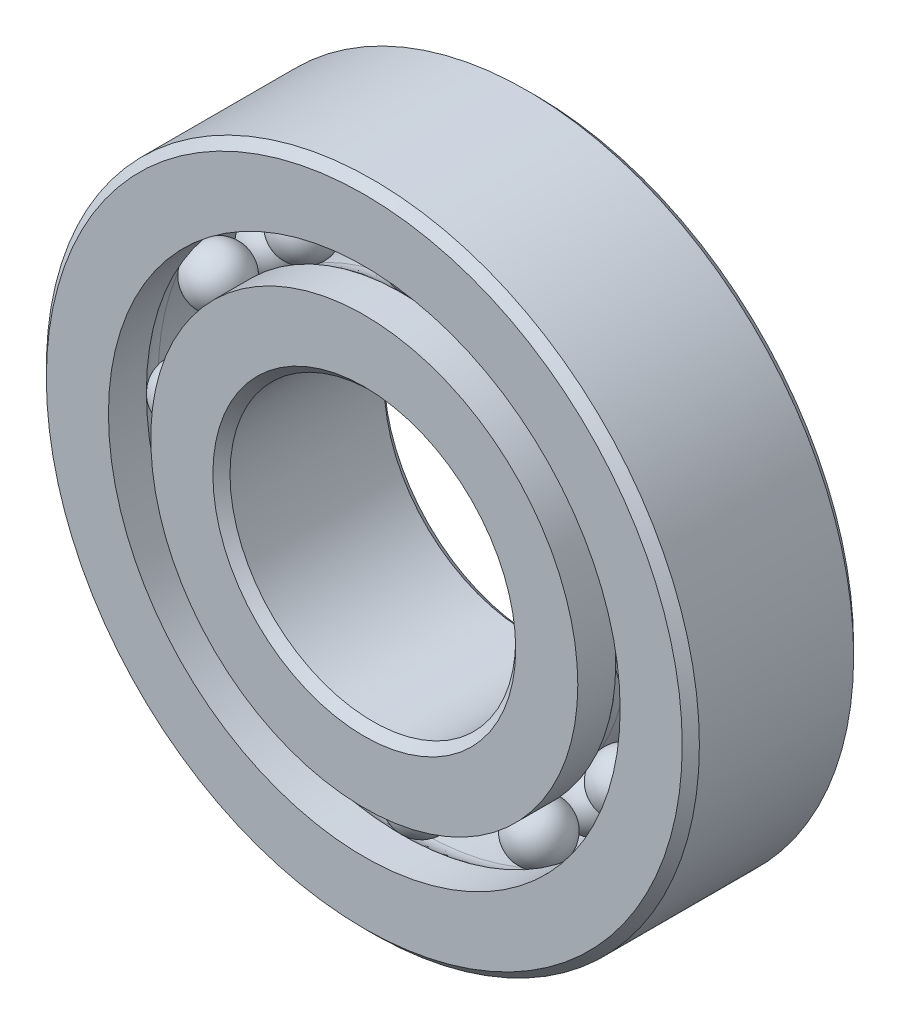
ISO-10303-21;
HEADER;
FILE_DESCRIPTION(('STEP AP214'),'2;1');
FILE_NAME('part.step','',(''),(''),'','','');
FILE_SCHEMA(('AUTOMOTIVE_DESIGN { 1 0 10303 214 1 1 1 1 }'));
ENDSEC;
DATA;
#1=APPLICATION_CONTEXT('core data for automotive mechanical design processes');
#2=APPLICATION_PROTOCOL_DEFINITION('international standard','automotive_design',2000,#1);
#3=PRODUCT_CONTEXT('',#1,'mechanical');
#4=PRODUCT('Part','Part','',(#3));
#5=PRODUCT_RELATED_PRODUCT_CATEGORY('part','',(#4));
#6=PRODUCT_DEFINITION_FORMATION('','',#4);
#7=PRODUCT_DEFINITION_CONTEXT('part definition',#1,'design');
#8=PRODUCT_DEFINITION('design','',#6,#7);
#9=PRODUCT_DEFINITION_SHAPE('','',#8);
#10=(LENGTH_UNIT() NAMED_UNIT(*) SI_UNIT(.MILLI.,.METRE.));
#11=(NAMED_UNIT(*) PLANE_ANGLE_UNIT() SI_UNIT($,.RADIAN.));
#12=(NAMED_UNIT(*) SI_UNIT($,.STERADIAN.) SOLID_ANGLE_UNIT());
#13=UNCERTAINTY_MEASURE_WITH_UNIT(LENGTH_MEASURE(1.E-05),#10,'distance_accuracy_value','');
#14=(GEOMETRIC_REPRESENTATION_CONTEXT(3) GLOBAL_UNCERTAINTY_ASSIGNED_CONTEXT((#13)) GLOBAL_UNIT_ASSIGNED_CONTEXT((#10,
#11,#12)) REPRESENTATION_CONTEXT('',''));
#15=CARTESIAN_POINT('',(0.,0.,0.));
#16=DIRECTION('',(0.,0.,1.));
#17=DIRECTION('',(1.,0.,0.));
#18=AXIS2_PLACEMENT_3D('',#15,#16,#17);
#19=CARTESIAN_POINT('',(-14.3749999999997,24.8982303588028,-3.5));
#20=DIRECTION('',(0.,0.,1.));
#21=DIRECTION('',(-0.499999999999989,0.866025403784445,0.));
#22=AXIS2_PLACEMENT_3D('',#19,#20,#21);
#23=SPHERICAL_SURFACE('',#22,3.5);
#24=CARTESIAN_POINT('',(-14.3749999999997,24.8982303588028,0.));
#25=VERTEX_POINT('',#24);
#26=VERTEX_LOOP('',#25);
#27=FACE_BOUND('',#26,.T.);
#28=ADVANCED_FACE('F41',(#27),#23,.T.);
#29=CLOSED_SHELL('',(#28));
#30=MANIFOLD_SOLID_BREP('B2',#29);
#31=CARTESIAN_POINT('',(-24.8982303588024,14.3750000000003,-3.5));
#32=DIRECTION('',(0.,0.,1.));
#33=DIRECTION('',(-0.866025403784433,0.50000000000001,0.));
#34=AXIS2_PLACEMENT_3D('',#31,#32,#33);
#35=SPHERICAL_SURFACE('',#34,3.5);
#36=CARTESIAN_POINT('',(-24.8982303588024,14.3750000000003,0.));
#37=VERTEX_POINT('',#36);
#38=VERTEX_LOOP('',#37);
#39=FACE_BOUND('',#38,.T.);
#40=ADVANCED_FACE('F61',(#39),#35,.T.);
#41=CLOSED_SHELL('',(#40));
#42=MANIFOLD_SOLID_BREP('B6',#41);
#43=CARTESIAN_POINT('',(-28.75,3.0114026547522E-13,-3.5));
#44=DIRECTION('',(0.,0.,1.));
#45=DIRECTION('',(-1.,0.,0.));
#46=AXIS2_PLACEMENT_3D('',#43,#44,#45);
#47=SPHERICAL_SURFACE('',#46,3.5);
#48=CARTESIAN_POINT('',(-28.75,3.0114026547522E-13,0.));
#49=VERTEX_POINT('',#48);
#50=VERTEX_LOOP('',#49);
#51=FACE_BOUND('',#50,.T.);
#52=ADVANCED_FACE('F81',(#51),#47,.T.);
#53=CLOSED_SHELL('',(#52));
#54=MANIFOLD_SOLID_BREP('B37',#53);
#55=CARTESIAN_POINT('',(-24.8982303588027,-14.3749999999998,-3.5));
#56=DIRECTION('',(0.,0.,1.));
#57=DIRECTION('',(-0.866025403784443,-0.499999999999992,0.));
#58=AXIS2_PLACEMENT_3D('',#55,#56,#57);
#59=SPHERICAL_SURFACE('',#58,3.5);
#60=CARTESIAN_POINT('',(-24.8982303588027,-14.3749999999998,0.));
#61=VERTEX_POINT('',#60);
#62=VERTEX_LOOP('',#61);
#63=FACE_BOUND('',#62,.T.);
#64=ADVANCED_FACE('F101',(#63),#59,.T.);
#65=CLOSED_SHELL('',(#64));
#66=MANIFOLD_SOLID_BREP('B57',#65);
#67=CARTESIAN_POINT('',(-14.3750000000002,-24.8982303588025,-3.5));
#68=DIRECTION('',(0.,0.,1.));
#69=DIRECTION('',(-0.500000000000007,-0.866025403784435,0.));
#70=AXIS2_PLACEMENT_3D('',#67,#68,#69);
#71=SPHERICAL_SURFACE('',#70,3.5);
#72=CARTESIAN_POINT('',(-14.3750000000002,-24.8982303588025,0.));
#73=VERTEX_POINT('',#72);
#74=VERTEX_LOOP('',#73);
#75=FACE_BOUND('',#74,.T.);
#76=ADVANCED_FACE('F121',(#75),#71,.T.);
#77=CLOSED_SHELL('',(#76));
#78=MANIFOLD_SOLID_BREP('B77',#77);
#79=CARTESIAN_POINT('',(-2.0076017698348E-13,-28.75,-3.5));
#80=DIRECTION('',(0.,0.,1.));
#81=DIRECTION('',(0.,-1.,0.));
#82=AXIS2_PLACEMENT_3D('',#79,#80,#81);
#83=SPHERICAL_SURFACE('',#82,3.5);
#84=CARTESIAN_POINT('',(-2.0076017698348E-13,-28.75,0.));
#85=VERTEX_POINT('',#84);
#86=VERTEX_LOOP('',#85);
#87=FACE_BOUND('',#86,.T.);
#88=ADVANCED_FACE('F141',(#87),#83,.T.);
#89=CLOSED_SHELL('',(#88));
#90=MANIFOLD_SOLID_BREP('B97',#89);
#91=CARTESIAN_POINT('',(14.3749999999999,-24.8982303588027,-3.5));
#92=DIRECTION('',(0.,0.,1.));
#93=DIRECTION('',(0.499999999999995,-0.866025403784442,0.));
#94=AXIS2_PLACEMENT_3D('',#91,#92,#93);
#95=SPHERICAL_SURFACE('',#94,3.5);
#96=CARTESIAN_POINT('',(14.3749999999999,-24.8982303588027,0.));
#97=VERTEX_POINT('',#96);
#98=VERTEX_LOOP('',#97);
#99=FACE_BOUND('',#98,.T.);
#100=ADVANCED_FACE('F161',(#99),#95,.T.);
#101=CLOSED_SHELL('',(#100));
#102=MANIFOLD_SOLID_BREP('B117',#101);
#103=CARTESIAN_POINT('',(24.8982303588026,-14.3750000000001,-3.5));
#104=DIRECTION('',(0.,0.,1.));
#105=DIRECTION('',(0.866025403784436,-0.500000000000004,0.));
#106=AXIS2_PLACEMENT_3D('',#103,#104,#105);
#107=SPHERICAL_SURFACE('',#106,3.5);
#108=CARTESIAN_POINT('',(24.8982303588026,-14.3750000000001,0.));
#109=VERTEX_POINT('',#108);
#110=VERTEX_LOOP('',#109);
#111=FACE_BOUND('',#110,.T.);
#112=ADVANCED_FACE('F181',(#111),#107,.T.);
#113=CLOSED_SHELL('',(#112));
#114=MANIFOLD_SOLID_BREP('B137',#113);
#115=CARTESIAN_POINT('',(28.75,-1.0038008849174E-13,-3.5));
#116=DIRECTION('',(0.,0.,1.));
#117=DIRECTION('',(1.,0.,0.));
#118=AXIS2_PLACEMENT_3D('',#115,#116,#117);
#119=SPHERICAL_SURFACE('',#118,3.5);
#120=CARTESIAN_POINT('',(28.75,-1.0038008849174E-13,0.));
#121=VERTEX_POINT('',#120);
#122=VERTEX_LOOP('',#121);
#123=FACE_BOUND('',#122,.T.);
#124=ADVANCED_FACE('F201',(#123),#119,.T.);
#125=CLOSED_SHELL('',(#124));
#126=MANIFOLD_SOLID_BREP('B157',#125);
#127=CARTESIAN_POINT('',(24.8982303588026,14.3749999999999,-3.5));
#128=DIRECTION('',(0.,0.,1.));
#129=DIRECTION('',(0.86602540378444,0.499999999999998,0.));
#130=AXIS2_PLACEMENT_3D('',#127,#128,#129);
#131=SPHERICAL_SURFACE('',#130,3.5);
#132=CARTESIAN_POINT('',(24.8982303588026,14.3749999999999,0.));
#133=VERTEX_POINT('',#132);
#134=VERTEX_LOOP('',#133);
#135=FACE_BOUND('',#134,.T.);
#136=ADVANCED_FACE('F221',(#135),#131,.T.);
#137=CLOSED_SHELL('',(#136));
#138=MANIFOLD_SOLID_BREP('B177',#137);
#139=CARTESIAN_POINT('',(14.375,24.8982303588026,-3.5));
#140=DIRECTION('',(0.,0.,1.));
#141=DIRECTION('',(0.500000000000001,0.866025403784438,0.));
#142=AXIS2_PLACEMENT_3D('',#139,#140,#141);
#143=SPHERICAL_SURFACE('',#142,3.5);
#144=CARTESIAN_POINT('',(14.375,24.8982303588026,0.));
#145=VERTEX_POINT('',#144);
#146=VERTEX_LOOP('',#145);
#147=FACE_BOUND('',#146,.T.);
#148=ADVANCED_FACE('F241',(#147),#143,.T.);
#149=CLOSED_SHELL('',(#148));
#150=MANIFOLD_SOLID_BREP('B197',#149);
#151=CARTESIAN_POINT('',(-14.3749999999997,24.8982303588028,3.5));
#152=DIRECTION('',(0.,0.,-1.));
#153=DIRECTION('',(-0.499999999999989,0.866025403784445,0.));
#154=AXIS2_PLACEMENT_3D('',#151,#152,#153);
#155=SPHERICAL_SURFACE('',#154,3.5);
#156=CARTESIAN_POINT('',(-14.3749999999997,24.8982303588028,0.));
#157=VERTEX_POINT('',#156);
#158=VERTEX_LOOP('',#157);
#159=FACE_BOUND('',#158,.T.);
#160=ADVANCED_FACE('F261',(#159),#155,.T.);
#161=CLOSED_SHELL('',(#160));
#162=MANIFOLD_SOLID_BREP('B217',#161);
#163=CARTESIAN_POINT('',(-24.8982303588024,14.3750000000003,3.5));
#164=DIRECTION('',(0.,0.,-1.));
#165=DIRECTION('',(-0.866025403784433,0.50000000000001,0.));
#166=AXIS2_PLACEMENT_3D('',#163,#164,#165);
#167=SPHERICAL_SURFACE('',#166,3.5);
#168=CARTESIAN_POINT('',(-24.8982303588024,14.3750000000003,0.));
#169=VERTEX_POINT('',#168);
#170=VERTEX_LOOP('',#169);
#171=FACE_BOUND('',#170,.T.);
#172=ADVANCED_FACE('F281',(#171),#167,.T.);
#173=CLOSED_SHELL('',(#172));
#174=MANIFOLD_SOLID_BREP('B237',#173);
#175=CARTESIAN_POINT('',(-28.75,3.0114026547522E-13,3.5));
#176=DIRECTION('',(0.,0.,-1.));
#177=DIRECTION('',(-1.,0.,0.));
#178=AXIS2_PLACEMENT_3D('',#175,#176,#177);
#179=SPHERICAL_SURFACE('',#178,3.5);
#180=CARTESIAN_POINT('',(-28.75,3.0114026547522E-13,0.));
#181=VERTEX_POINT('',#180);
#182=VERTEX_LOOP('',#181);
#183=FACE_BOUND('',#182,.T.);
#184=ADVANCED_FACE('F301',(#183),#179,.T.);
#185=CLOSED_SHELL('',(#184));
#186=MANIFOLD_SOLID_BREP('B257',#185);
#187=CARTESIAN_POINT('',(-24.8982303588027,-14.3749999999998,3.5));
#188=DIRECTION('',(0.,0.,-1.));
#189=DIRECTION('',(-0.866025403784443,-0.499999999999992,0.));
#190=AXIS2_PLACEMENT_3D('',#187,#188,#189);
#191=SPHERICAL_SURFACE('',#190,3.5);
#192=CARTESIAN_POINT('',(-24.8982303588027,-14.3749999999998,0.));
#193=VERTEX_POINT('',#192);
#194=VERTEX_LOOP('',#193);
#195=FACE_BOUND('',#194,.T.);
#196=ADVANCED_FACE('F321',(#195),#191,.T.);
#197=CLOSED_SHELL('',(#196));
#198=MANIFOLD_SOLID_BREP('B277',#197);
#199=CARTESIAN_POINT('',(-14.3750000000002,-24.8982303588025,3.5));
#200=DIRECTION('',(0.,0.,-1.));
#201=DIRECTION('',(-0.500000000000007,-0.866025403784435,0.));
#202=AXIS2_PLACEMENT_3D('',#199,#200,#201);
#203=SPHERICAL_SURFACE('',#202,3.5);
#204=CARTESIAN_POINT('',(-14.3750000000002,-24.8982303588025,0.));
#205=VERTEX_POINT('',#204);
#206=VERTEX_LOOP('',#205);
#207=FACE_BOUND('',#206,.T.);
#208=ADVANCED_FACE('F341',(#207),#203,.T.);
#209=CLOSED_SHELL('',(#208));
#210=MANIFOLD_SOLID_BREP('B297',#209);
#211=CARTESIAN_POINT('',(-2.0076017698348E-13,-28.75,3.5));
#212=DIRECTION('',(0.,0.,-1.));
#213=DIRECTION('',(0.,-1.,0.));
#214=AXIS2_PLACEMENT_3D('',#211,#212,#213);
#215=SPHERICAL_SURFACE('',#214,3.5);
#216=CARTESIAN_POINT('',(-2.0076017698348E-13,-28.75,0.));
#217=VERTEX_POINT('',#216);
#218=VERTEX_LOOP('',#217);
#219=FACE_BOUND('',#218,.T.);
#220=ADVANCED_FACE('F361',(#219),#215,.T.);
#221=CLOSED_SHELL('',(#220));
#222=MANIFOLD_SOLID_BREP('B317',#221);
#223=CARTESIAN_POINT('',(14.3749999999999,-24.8982303588027,3.5));
#224=DIRECTION('',(0.,0.,-1.));
#225=DIRECTION('',(0.499999999999995,-0.866025403784442,0.));
#226=AXIS2_PLACEMENT_3D('',#223,#224,#225);
#227=SPHERICAL_SURFACE('',#226,3.5);
#228=CARTESIAN_POINT('',(14.3749999999999,-24.8982303588027,0.));
#229=VERTEX_POINT('',#228);
#230=VERTEX_LOOP('',#229);
#231=FACE_BOUND('',#230,.T.);
#232=ADVANCED_FACE('F381',(#231),#227,.T.);
#233=CLOSED_SHELL('',(#232));
#234=MANIFOLD_SOLID_BREP('B337',#233);
#235=CARTESIAN_POINT('',(24.8982303588026,-14.3750000000001,3.5));
#236=DIRECTION('',(0.,0.,-1.));
#237=DIRECTION('',(0.866025403784436,-0.500000000000004,0.));
#238=AXIS2_PLACEMENT_3D('',#235,#236,#237);
#239=SPHERICAL_SURFACE('',#238,3.5);
#240=CARTESIAN_POINT('',(24.8982303588026,-14.3750000000001,0.));
#241=VERTEX_POINT('',#240);
#242=VERTEX_LOOP('',#241);
#243=FACE_BOUND('',#242,.T.);
#244=ADVANCED_FACE('F401',(#243),#239,.T.);
#245=CLOSED_SHELL('',(#244));
#246=MANIFOLD_SOLID_BREP('B357',#245);
#247=CARTESIAN_POINT('',(28.75,-1.0038008849174E-13,3.5));
#248=DIRECTION('',(0.,0.,-1.));
#249=DIRECTION('',(1.,0.,0.));
#250=AXIS2_PLACEMENT_3D('',#247,#248,#249);
#251=SPHERICAL_SURFACE('',#250,3.5);
#252=CARTESIAN_POINT('',(28.75,-1.0038008849174E-13,0.));
#253=VERTEX_POINT('',#252);
#254=VERTEX_LOOP('',#253);
#255=FACE_BOUND('',#254,.T.);
#256=ADVANCED_FACE('F421',(#255),#251,.T.);
#257=CLOSED_SHELL('',(#256));
#258=MANIFOLD_SOLID_BREP('B377',#257);
#259=CARTESIAN_POINT('',(24.8982303588026,14.3749999999999,3.5));
#260=DIRECTION('',(0.,0.,-1.));
#261=DIRECTION('',(0.86602540378444,0.499999999999998,0.));
#262=AXIS2_PLACEMENT_3D('',#259,#260,#261);
#263=SPHERICAL_SURFACE('',#262,3.5);
#264=CARTESIAN_POINT('',(24.8982303588026,14.3749999999999,0.));
#265=VERTEX_POINT('',#264);
#266=VERTEX_LOOP('',#265);
#267=FACE_BOUND('',#266,.T.);
#268=ADVANCED_FACE('F441',(#267),#263,.T.);
#269=CLOSED_SHELL('',(#268));
#270=MANIFOLD_SOLID_BREP('B397',#269);
#271=CARTESIAN_POINT('',(14.375,24.8982303588026,3.5));
#272=DIRECTION('',(0.,0.,-1.));
#273=DIRECTION('',(0.500000000000001,0.866025403784438,0.));
#274=AXIS2_PLACEMENT_3D('',#271,#272,#273);
#275=SPHERICAL_SURFACE('',#274,3.5);
#276=CARTESIAN_POINT('',(14.375,24.8982303588026,0.));
#277=VERTEX_POINT('',#276);
#278=VERTEX_LOOP('',#277);
#279=FACE_BOUND('',#278,.T.);
#280=ADVANCED_FACE('F461',(#279),#275,.T.);
#281=CLOSED_SHELL('',(#280));
#282=MANIFOLD_SOLID_BREP('B417',#281);
#283=CARTESIAN_POINT('',(0.,28.75,3.5));
#284=DIRECTION('',(0.,0.,-1.));
#285=DIRECTION('',(0.,1.,0.));
#286=AXIS2_PLACEMENT_3D('',#283,#284,#285);
#287=SPHERICAL_SURFACE('',#286,3.5);
#288=CARTESIAN_POINT('',(0.,28.75,0.));
#289=VERTEX_POINT('',#288);
#290=VERTEX_LOOP('',#289);
#291=FACE_BOUND('',#290,.T.);
#292=ADVANCED_FACE('F481',(#291),#287,.T.);
#293=CLOSED_SHELL('',(#292));
#294=MANIFOLD_SOLID_BREP('B437',#293);
#295=CARTESIAN_POINT('',(0.,28.75,-3.5));
#296=DIRECTION('',(0.,0.,1.));
#297=DIRECTION('',(0.,1.,0.));
#298=AXIS2_PLACEMENT_3D('',#295,#296,#297);
#299=SPHERICAL_SURFACE('',#298,3.5);
#300=CARTESIAN_POINT('',(0.,28.75,0.));
#301=VERTEX_POINT('',#300);
#302=VERTEX_LOOP('',#301);
#303=FACE_BOUND('',#302,.T.);
#304=ADVANCED_FACE('F503',(#303),#299,.T.);
#305=CLOSED_SHELL('',(#304));
#306=MANIFOLD_SOLID_BREP('B457',#305);
#307=CARTESIAN_POINT('',(0.,26.1565934065934,10.5));
#308=DIRECTION('',(0.,0.,-1.));
#309=DIRECTION('',(-1.,0.,0.));
#310=AXIS2_PLACEMENT_3D('',#307,#308,#309);
#311=PLANE('',#310);
#312=CARTESIAN_POINT('',(0.,0.,10.5));
#313=DIRECTION('',(0.,0.,1.));
#314=DIRECTION('',(1.,0.,0.));
#315=AXIS2_PLACEMENT_3D('',#312,#313,#314);
#316=CIRCLE('',#315,18.55);
#317=CARTESIAN_POINT('',(18.55,0.,10.5));
#318=VERTEX_POINT('',#317);
#319=EDGE_CURVE('E502',#318,#318,#316,.T.);
#320=ORIENTED_EDGE('',*,*,#319,.F.);
#321=EDGE_LOOP('',(#320));
#322=FACE_BOUND('',#321,.T.);
#323=CARTESIAN_POINT('',(0.,0.,10.5));
#324=DIRECTION('',(0.,0.,1.));
#325=DIRECTION('',(1.,0.,0.));
#326=AXIS2_PLACEMENT_3D('',#323,#324,#325);
#327=CIRCLE('',#326,26.1565934065934);
#328=CARTESIAN_POINT('',(26.1565934065934,0.,10.5));
#329=VERTEX_POINT('',#328);
#330=EDGE_CURVE('E556',#329,#329,#327,.T.);
#331=ORIENTED_EDGE('',*,*,#330,.T.);
#332=EDGE_LOOP('',(#331));
#333=FACE_BOUND('',#332,.T.);
#334=ADVANCED_FACE('F522',(#322,#333),#311,.F.);
#335=CARTESIAN_POINT('',(0.,0.,10.5));
#336=DIRECTION('',(0.,0.,1.));
#337=DIRECTION('',(1.,0.,0.));
#338=AXIS2_PLACEMENT_3D('',#335,#336,#337);
#339=CONICAL_SURFACE('',#338,18.55,0.785398163397452);
#340=CARTESIAN_POINT('',(0.,0.,9.45));
#341=DIRECTION('',(0.,0.,1.));
#342=DIRECTION('',(1.,0.,0.));
#343=AXIS2_PLACEMENT_3D('',#340,#341,#342);
#344=CIRCLE('',#343,17.5);
#345=CARTESIAN_POINT('',(17.5,0.,9.45));
#346=VERTEX_POINT('',#345);
#347=EDGE_CURVE('E528',#346,#346,#344,.T.);
#348=ORIENTED_EDGE('',*,*,#347,.F.);
#349=EDGE_LOOP('',(#348));
#350=FACE_BOUND('',#349,.T.);
#351=ORIENTED_EDGE('',*,*,#319,.T.);
#352=EDGE_LOOP('',(#351));
#353=FACE_BOUND('',#352,.T.);
#354=ADVANCED_FACE('F605',(#350,#353),#339,.F.);
#355=CARTESIAN_POINT('',(0.,0.,10.5));
#356=DIRECTION('',(0.,0.,1.));
#357=DIRECTION('',(1.,0.,0.));
#358=AXIS2_PLACEMENT_3D('',#355,#356,#357);
#359=CYLINDRICAL_SURFACE('',#358,17.5);
#360=CARTESIAN_POINT('',(0.,0.,-9.45));
#361=DIRECTION('',(0.,0.,1.));
#362=DIRECTION('',(1.,0.,0.));
#363=AXIS2_PLACEMENT_3D('',#360,#361,#362);
#364=CIRCLE('',#363,17.5);
#365=CARTESIAN_POINT('',(17.5,0.,-9.45));
#366=VERTEX_POINT('',#365);
#367=EDGE_CURVE('E532',#366,#366,#364,.T.);
#368=ORIENTED_EDGE('',*,*,#367,.F.);
#369=EDGE_LOOP('',(#368));
#370=FACE_BOUND('',#369,.T.);
#371=ORIENTED_EDGE('',*,*,#347,.T.);
#372=EDGE_LOOP('',(#371));
#373=FACE_BOUND('',#372,.T.);
#374=ADVANCED_FACE('F600',(#370,#373),#359,.F.);
#375=CARTESIAN_POINT('',(0.,0.,-9.45));
#376=DIRECTION('',(0.,0.,-1.));
#377=DIRECTION('',(-1.,0.,0.));
#378=AXIS2_PLACEMENT_3D('',#375,#376,#377);
#379=CONICAL_SURFACE('',#378,17.5,0.785398163397447);
#380=CARTESIAN_POINT('',(0.,0.,-10.5));
#381=DIRECTION('',(0.,0.,1.));
#382=DIRECTION('',(1.,0.,0.));
#383=AXIS2_PLACEMENT_3D('',#380,#381,#382);
#384=CIRCLE('',#383,18.55);
#385=CARTESIAN_POINT('',(18.55,0.,-10.5));
#386=VERTEX_POINT('',#385);
#387=EDGE_CURVE('E536',#386,#386,#384,.T.);
#388=ORIENTED_EDGE('',*,*,#387,.F.);
#389=EDGE_LOOP('',(#388));
#390=FACE_BOUND('',#389,.T.);
#391=ORIENTED_EDGE('',*,*,#367,.T.);
#392=EDGE_LOOP('',(#391));
#393=FACE_BOUND('',#392,.T.);
#394=ADVANCED_FACE('F594',(#390,#393),#379,.F.);
#395=CARTESIAN_POINT('',(0.,18.55,-10.5));
#396=DIRECTION('',(0.,0.,1.));
#397=DIRECTION('',(1.,0.,0.));
#398=AXIS2_PLACEMENT_3D('',#395,#396,#397);
#399=PLANE('',#398);
#400=CARTESIAN_POINT('',(0.,0.,-10.5));
#401=DIRECTION('',(0.,0.,1.));
#402=DIRECTION('',(1.,0.,0.));
#403=AXIS2_PLACEMENT_3D('',#400,#401,#402);
#404=CIRCLE('',#403,26.1565934065934);
#405=CARTESIAN_POINT('',(26.1565934065934,0.,-10.5));
#406=VERTEX_POINT('',#405);
#407=EDGE_CURVE('E541',#406,#406,#404,.T.);
#408=ORIENTED_EDGE('',*,*,#407,.F.);
#409=EDGE_LOOP('',(#408));
#410=FACE_BOUND('',#409,.T.);
#411=ORIENTED_EDGE('',*,*,#387,.T.);
#412=EDGE_LOOP('',(#411));
#413=FACE_BOUND('',#412,.T.);
#414=ADVANCED_FACE('F588',(#410,#413),#399,.F.);
#415=CARTESIAN_POINT('',(0.,0.,10.5));
#416=DIRECTION('',(0.,0.,1.));
#417=DIRECTION('',(1.,0.,0.));
#418=AXIS2_PLACEMENT_3D('',#415,#416,#417);
#419=CYLINDRICAL_SURFACE('',#418,26.1565934065934);
#420=CARTESIAN_POINT('',(0.,0.,-5.85037066040131));
#421=DIRECTION('',(0.,0.,1.));
#422=DIRECTION('',(1.,0.,0.));
#423=AXIS2_PLACEMENT_3D('',#420,#421,#422);
#424=CIRCLE('',#423,26.1565934065934);
#425=CARTESIAN_POINT('',(26.1565934065934,0.,-5.85037066040131));
#426=VERTEX_POINT('',#425);
#427=EDGE_CURVE('E544',#426,#426,#424,.T.);
#428=ORIENTED_EDGE('',*,*,#427,.F.);
#429=EDGE_LOOP('',(#428));
#430=FACE_BOUND('',#429,.T.);
#431=ORIENTED_EDGE('',*,*,#407,.T.);
#432=EDGE_LOOP('',(#431));
#433=FACE_BOUND('',#432,.T.);
#434=ADVANCED_FACE('F582',(#430,#433),#419,.T.);
#435=CARTESIAN_POINT('',(0.,0.,-3.5));
#436=DIRECTION('',(0.,0.,1.));
#437=DIRECTION('',(1.,0.,0.));
#438=AXIS2_PLACEMENT_3D('',#435,#436,#437);
#439=TOROIDAL_SURFACE('',#438,28.75,3.5);
#440=CARTESIAN_POINT('',(0.,0.,-3.5));
#441=DIRECTION('',(0.,0.,1.));
#442=DIRECTION('',(1.,0.,0.));
#443=AXIS2_PLACEMENT_3D('',#440,#441,#442);
#444=CIRCLE('',#443,25.25);
#445=CARTESIAN_POINT('',(25.25,0.,-3.5));
#446=VERTEX_POINT('',#445);
#447=EDGE_CURVE('E547',#446,#446,#444,.T.);
#448=ORIENTED_EDGE('',*,*,#447,.F.);
#449=EDGE_LOOP('',(#448));
#450=FACE_BOUND('',#449,.T.);
#451=ORIENTED_EDGE('',*,*,#427,.T.);
#452=EDGE_LOOP('',(#451));
#453=FACE_BOUND('',#452,.T.);
#454=ADVANCED_FACE('F576',(#450,#453),#439,.F.);
#455=CARTESIAN_POINT('',(0.,0.,10.5));
#456=DIRECTION('',(0.,0.,1.));
#457=DIRECTION('',(1.,0.,0.));
#458=AXIS2_PLACEMENT_3D('',#455,#456,#457);
#459=CYLINDRICAL_SURFACE('',#458,25.25);
#460=CARTESIAN_POINT('',(0.,0.,3.5));
#461=DIRECTION('',(0.,0.,1.));
#462=DIRECTION('',(1.,0.,0.));
#463=AXIS2_PLACEMENT_3D('',#460,#461,#462);
#464=CIRCLE('',#463,25.25);
#465=CARTESIAN_POINT('',(25.25,0.,3.5));
#466=VERTEX_POINT('',#465);
#467=EDGE_CURVE('E550',#466,#466,#464,.T.);
#468=ORIENTED_EDGE('',*,*,#467,.F.);
#469=EDGE_LOOP('',(#468));
#470=FACE_BOUND('',#469,.T.);
#471=ORIENTED_EDGE('',*,*,#447,.T.);
#472=EDGE_LOOP('',(#471));
#473=FACE_BOUND('',#472,.T.);
#474=ADVANCED_FACE('F570',(#470,#473),#459,.T.);
#475=CARTESIAN_POINT('',(0.,0.,3.5));
#476=DIRECTION('',(0.,0.,1.));
#477=DIRECTION('',(1.,0.,0.));
#478=AXIS2_PLACEMENT_3D('',#475,#476,#477);
#479=TOROIDAL_SURFACE('',#478,28.75,3.5);
#480=CARTESIAN_POINT('',(0.,0.,5.8503706604013));
#481=DIRECTION('',(0.,0.,1.));
#482=DIRECTION('',(1.,0.,0.));
#483=AXIS2_PLACEMENT_3D('',#480,#481,#482);
#484=CIRCLE('',#483,26.1565934065934);
#485=CARTESIAN_POINT('',(26.1565934065934,0.,5.8503706604013));
#486=VERTEX_POINT('',#485);
#487=EDGE_CURVE('E553',#486,#486,#484,.T.);
#488=ORIENTED_EDGE('',*,*,#487,.F.);
#489=EDGE_LOOP('',(#488));
#490=FACE_BOUND('',#489,.T.);
#491=ORIENTED_EDGE('',*,*,#467,.T.);
#492=EDGE_LOOP('',(#491));
#493=FACE_BOUND('',#492,.T.);
#494=ADVANCED_FACE('F564',(#490,#493),#479,.F.);
#495=CARTESIAN_POINT('',(0.,0.,10.5));
#496=DIRECTION('',(0.,0.,1.));
#497=DIRECTION('',(1.,0.,0.));
#498=AXIS2_PLACEMENT_3D('',#495,#496,#497);
#499=CYLINDRICAL_SURFACE('',#498,26.1565934065934);
#500=ORIENTED_EDGE('',*,*,#330,.F.);
#501=EDGE_LOOP('',(#500));
#502=FACE_BOUND('',#501,.T.);
#503=ORIENTED_EDGE('',*,*,#487,.T.);
#504=EDGE_LOOP('',(#503));
#505=FACE_BOUND('',#504,.T.);
#506=ADVANCED_FACE('F561',(#502,#505),#499,.T.);
#507=CLOSED_SHELL('',(#334,#354,#374,#394,#414,#434,#454,#474,#494,#506));
#508=MANIFOLD_SOLID_BREP('B477',#507);
#509=CARTESIAN_POINT('',(0.,0.,9.45));
#510=DIRECTION('',(0.,0.,-1.));
#511=DIRECTION('',(-1.,0.,0.));
#512=AXIS2_PLACEMENT_3D('',#509,#510,#511);
#513=CONICAL_SURFACE('',#512,40.,0.785398163397446);
#514=CARTESIAN_POINT('',(0.,0.,10.5));
#515=DIRECTION('',(0.,0.,1.));
#516=DIRECTION('',(1.,0.,0.));
#517=AXIS2_PLACEMENT_3D('',#514,#515,#516);
#518=CIRCLE('',#517,38.95);
#519=CARTESIAN_POINT('',(38.95,0.,10.5));
#520=VERTEX_POINT('',#519);
#521=EDGE_CURVE('E521',#520,#520,#518,.T.);
#522=ORIENTED_EDGE('',*,*,#521,.F.);
#523=EDGE_LOOP('',(#522));
#524=FACE_BOUND('',#523,.T.);
#525=CARTESIAN_POINT('',(0.,0.,9.45));
#526=DIRECTION('',(0.,0.,1.));
#527=DIRECTION('',(1.,0.,0.));
#528=AXIS2_PLACEMENT_3D('',#525,#526,#527);
#529=CIRCLE('',#528,40.);
#530=CARTESIAN_POINT('',(40.,0.,9.45));
#531=VERTEX_POINT('',#530);
#532=EDGE_CURVE('E707',#531,#531,#529,.T.);
#533=ORIENTED_EDGE('',*,*,#532,.T.);
#534=EDGE_LOOP('',(#533));
#535=FACE_BOUND('',#534,.T.);
#536=ADVANCED_FACE('F673',(#524,#535),#513,.T.);
#537=CARTESIAN_POINT('',(0.,38.95,10.5));
#538=DIRECTION('',(0.,0.,-1.));
#539=DIRECTION('',(-1.,0.,0.));
#540=AXIS2_PLACEMENT_3D('',#537,#538,#539);
#541=PLANE('',#540);
#542=CARTESIAN_POINT('',(0.,0.,10.5));
#543=DIRECTION('',(0.,0.,1.));
#544=DIRECTION('',(1.,0.,0.));
#545=AXIS2_PLACEMENT_3D('',#542,#543,#544);
#546=CIRCLE('',#545,31.3434065934066);
#547=CARTESIAN_POINT('',(31.3434065934066,0.,10.5));
#548=VERTEX_POINT('',#547);
#549=EDGE_CURVE('E679',#548,#548,#546,.T.);
#550=ORIENTED_EDGE('',*,*,#549,.F.);
#551=EDGE_LOOP('',(#550));
#552=FACE_BOUND('',#551,.T.);
#553=ORIENTED_EDGE('',*,*,#521,.T.);
#554=EDGE_LOOP('',(#553));
#555=FACE_BOUND('',#554,.T.);
#556=ADVANCED_FACE('F756',(#552,#555),#541,.F.);
#557=CARTESIAN_POINT('',(0.,0.,10.5));
#558=DIRECTION('',(0.,0.,1.));
#559=DIRECTION('',(1.,0.,0.));
#560=AXIS2_PLACEMENT_3D('',#557,#558,#559);
#561=CYLINDRICAL_SURFACE('',#560,31.3434065934066);
#562=CARTESIAN_POINT('',(0.,0.,5.8503706604013));
#563=DIRECTION('',(0.,0.,1.));
#564=DIRECTION('',(1.,0.,0.));
#565=AXIS2_PLACEMENT_3D('',#562,#563,#564);
#566=CIRCLE('',#565,31.3434065934066);
#567=CARTESIAN_POINT('',(31.3434065934066,0.,5.8503706604013));
#568=VERTEX_POINT('',#567);
#569=EDGE_CURVE('E683',#568,#568,#566,.T.);
#570=ORIENTED_EDGE('',*,*,#569,.F.);
#571=EDGE_LOOP('',(#570));
#572=FACE_BOUND('',#571,.T.);
#573=ORIENTED_EDGE('',*,*,#549,.T.);
#574=EDGE_LOOP('',(#573));
#575=FACE_BOUND('',#574,.T.);
#576=ADVANCED_FACE('F751',(#572,#575),#561,.F.);
#577=CARTESIAN_POINT('',(0.,0.,3.5));
#578=DIRECTION('',(0.,0.,1.));
#579=DIRECTION('',(1.,0.,0.));
#580=AXIS2_PLACEMENT_3D('',#577,#578,#579);
#581=TOROIDAL_SURFACE('',#580,28.75,3.50000000000001);
#582=CARTESIAN_POINT('',(0.,0.,3.5));
#583=DIRECTION('',(0.,0.,1.));
#584=DIRECTION('',(1.,0.,0.));
#585=AXIS2_PLACEMENT_3D('',#582,#583,#584);
#586=CIRCLE('',#585,32.25);
#587=CARTESIAN_POINT('',(32.25,0.,3.5));
#588=VERTEX_POINT('',#587);
#589=EDGE_CURVE('E687',#588,#588,#586,.T.);
#590=ORIENTED_EDGE('',*,*,#589,.F.);
#591=EDGE_LOOP('',(#590));
#592=FACE_BOUND('',#591,.T.);
#593=ORIENTED_EDGE('',*,*,#569,.T.);
#594=EDGE_LOOP('',(#593));
#595=FACE_BOUND('',#594,.T.);
#596=ADVANCED_FACE('F745',(#592,#595),#581,.F.);
#597=CARTESIAN_POINT('',(0.,0.,10.5));
#598=DIRECTION('',(0.,0.,1.));
#599=DIRECTION('',(1.,0.,0.));
#600=AXIS2_PLACEMENT_3D('',#597,#598,#599);
#601=CYLINDRICAL_SURFACE('',#600,32.25);
#602=CARTESIAN_POINT('',(0.,0.,-3.5));
#603=DIRECTION('',(0.,0.,1.));
#604=DIRECTION('',(1.,0.,0.));
#605=AXIS2_PLACEMENT_3D('',#602,#603,#604);
#606=CIRCLE('',#605,32.25);
#607=CARTESIAN_POINT('',(32.25,0.,-3.5));
#608=VERTEX_POINT('',#607);
#609=EDGE_CURVE('E692',#608,#608,#606,.T.);
#610=ORIENTED_EDGE('',*,*,#609,.F.);
#611=EDGE_LOOP('',(#610));
#612=FACE_BOUND('',#611,.T.);
#613=ORIENTED_EDGE('',*,*,#589,.T.);
#614=EDGE_LOOP('',(#613));
#615=FACE_BOUND('',#614,.T.);
#616=ADVANCED_FACE('F739',(#612,#615),#601,.F.);
#617=CARTESIAN_POINT('',(0.,0.,-3.5));
#618=DIRECTION('',(0.,0.,1.));
#619=DIRECTION('',(1.,0.,0.));
#620=AXIS2_PLACEMENT_3D('',#617,#618,#619);
#621=TOROIDAL_SURFACE('',#620,28.75,3.50000000000001);
#622=CARTESIAN_POINT('',(0.,0.,-5.8503706604013));
#623=DIRECTION('',(0.,0.,1.));
#624=DIRECTION('',(1.,0.,0.));
#625=AXIS2_PLACEMENT_3D('',#622,#623,#624);
#626=CIRCLE('',#625,31.3434065934066);
#627=CARTESIAN_POINT('',(31.3434065934066,0.,-5.8503706604013));
#628=VERTEX_POINT('',#627);
#629=EDGE_CURVE('E695',#628,#628,#626,.T.);
#630=ORIENTED_EDGE('',*,*,#629,.F.);
#631=EDGE_LOOP('',(#630));
#632=FACE_BOUND('',#631,.T.);
#633=ORIENTED_EDGE('',*,*,#609,.T.);
#634=EDGE_LOOP('',(#633));
#635=FACE_BOUND('',#634,.T.);
#636=ADVANCED_FACE('F733',(#632,#635),#621,.F.);
#637=CARTESIAN_POINT('',(0.,0.,10.5));
#638=DIRECTION('',(0.,0.,1.));
#639=DIRECTION('',(1.,0.,0.));
#640=AXIS2_PLACEMENT_3D('',#637,#638,#639);
#641=CYLINDRICAL_SURFACE('',#640,31.3434065934066);
#642=CARTESIAN_POINT('',(0.,0.,-10.5));
#643=DIRECTION('',(0.,0.,1.));
#644=DIRECTION('',(1.,0.,0.));
#645=AXIS2_PLACEMENT_3D('',#642,#643,#644);
#646=CIRCLE('',#645,31.3434065934066);
#647=CARTESIAN_POINT('',(31.3434065934066,0.,-10.5));
#648=VERTEX_POINT('',#647);
#649=EDGE_CURVE('E698',#648,#648,#646,.T.);
#650=ORIENTED_EDGE('',*,*,#649,.F.);
#651=EDGE_LOOP('',(#650));
#652=FACE_BOUND('',#651,.T.);
#653=ORIENTED_EDGE('',*,*,#629,.T.);
#654=EDGE_LOOP('',(#653));
#655=FACE_BOUND('',#654,.T.);
#656=ADVANCED_FACE('F727',(#652,#655),#641,.F.);
#657=CARTESIAN_POINT('',(0.,38.95,-10.5));
#658=DIRECTION('',(0.,0.,1.));
#659=DIRECTION('',(1.,0.,0.));
#660=AXIS2_PLACEMENT_3D('',#657,#658,#659);
#661=PLANE('',#660);
#662=CARTESIAN_POINT('',(0.,0.,-10.5));
#663=DIRECTION('',(0.,0.,1.));
#664=DIRECTION('',(1.,0.,0.));
#665=AXIS2_PLACEMENT_3D('',#662,#663,#664);
#666=CIRCLE('',#665,38.95);
#667=CARTESIAN_POINT('',(38.95,0.,-10.5));
#668=VERTEX_POINT('',#667);
#669=EDGE_CURVE('E701',#668,#668,#666,.T.);
#670=ORIENTED_EDGE('',*,*,#669,.F.);
#671=EDGE_LOOP('',(#670));
#672=FACE_BOUND('',#671,.T.);
#673=ORIENTED_EDGE('',*,*,#649,.T.);
#674=EDGE_LOOP('',(#673));
#675=FACE_BOUND('',#674,.T.);
#676=ADVANCED_FACE('F721',(#672,#675),#661,.F.);
#677=CARTESIAN_POINT('',(0.,0.,-10.5));
#678=DIRECTION('',(0.,0.,1.));
#679=DIRECTION('',(1.,0.,0.));
#680=AXIS2_PLACEMENT_3D('',#677,#678,#679);
#681=CONICAL_SURFACE('',#680,38.95,0.785398163397447);
#682=CARTESIAN_POINT('',(0.,0.,-9.45));
#683=DIRECTION('',(0.,0.,1.));
#684=DIRECTION('',(1.,0.,0.));
#685=AXIS2_PLACEMENT_3D('',#682,#683,#684);
#686=CIRCLE('',#685,40.);
#687=CARTESIAN_POINT('',(40.,0.,-9.45));
#688=VERTEX_POINT('',#687);
#689=EDGE_CURVE('E704',#688,#688,#686,.T.);
#690=ORIENTED_EDGE('',*,*,#689,.F.);
#691=EDGE_LOOP('',(#690));
#692=FACE_BOUND('',#691,.T.);
#693=ORIENTED_EDGE('',*,*,#669,.T.);
#694=EDGE_LOOP('',(#693));
#695=FACE_BOUND('',#694,.T.);
#696=ADVANCED_FACE('F715',(#692,#695),#681,.T.);
#697=CARTESIAN_POINT('',(0.,0.,10.5));
#698=DIRECTION('',(0.,0.,1.));
#699=DIRECTION('',(1.,0.,0.));
#700=AXIS2_PLACEMENT_3D('',#697,#698,#699);
#701=CYLINDRICAL_SURFACE('',#700,40.);
#702=ORIENTED_EDGE('',*,*,#532,.F.);
#703=EDGE_LOOP('',(#702));
#704=FACE_BOUND('',#703,.T.);
#705=ORIENTED_EDGE('',*,*,#689,.T.);
#706=EDGE_LOOP('',(#705));
#707=FACE_BOUND('',#706,.T.);
#708=ADVANCED_FACE('F712',(#704,#707),#701,.T.);
#709=CLOSED_SHELL('',(#536,#556,#576,#596,#616,#636,#656,#676,#696,#708));
#710=MANIFOLD_SOLID_BREP('B497',#709);
#711=ADVANCED_BREP_SHAPE_REPRESENTATION('',(#18,#30,#42,#54,#66,#78,#90,#102,#114,#126,#138,
#150,#162,#174,#186,#198,#210,#222,#234,#246,#258,#270,#282,#294,#306,#508,#710),#14);
#712=SHAPE_DEFINITION_REPRESENTATION(#9,#711);
ENDSEC;
END-ISO-10303-21;
